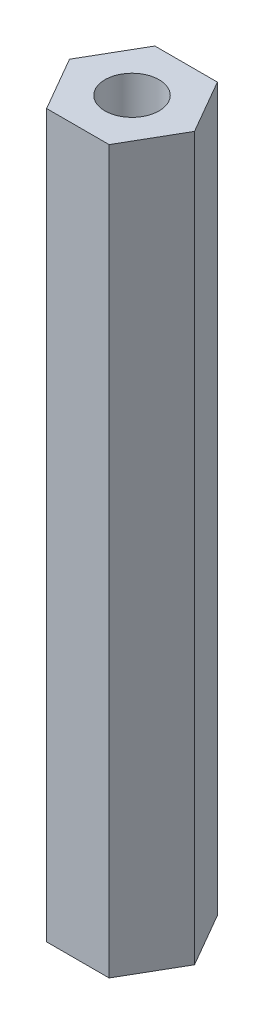
ISO-10303-21;
HEADER;
FILE_DESCRIPTION(('STEP AP214'),'2;1');
FILE_NAME('part.step','',(''),(''),'','','');
FILE_SCHEMA(('AUTOMOTIVE_DESIGN { 1 0 10303 214 1 1 1 1 }'));
ENDSEC;
DATA;
#1=APPLICATION_CONTEXT('core data for automotive mechanical design processes');
#2=APPLICATION_PROTOCOL_DEFINITION('international standard','automotive_design',2000,#1);
#3=PRODUCT_CONTEXT('',#1,'mechanical');
#4=PRODUCT('Part','Part','',(#3));
#5=PRODUCT_RELATED_PRODUCT_CATEGORY('part','',(#4));
#6=PRODUCT_DEFINITION_FORMATION('','',#4);
#7=PRODUCT_DEFINITION_CONTEXT('part definition',#1,'design');
#8=PRODUCT_DEFINITION('design','',#6,#7);
#9=PRODUCT_DEFINITION_SHAPE('','',#8);
#10=(LENGTH_UNIT() NAMED_UNIT(*) SI_UNIT(.MILLI.,.METRE.));
#11=(NAMED_UNIT(*) PLANE_ANGLE_UNIT() SI_UNIT($,.RADIAN.));
#12=(NAMED_UNIT(*) SI_UNIT($,.STERADIAN.) SOLID_ANGLE_UNIT());
#13=UNCERTAINTY_MEASURE_WITH_UNIT(LENGTH_MEASURE(1.E-05),#10,'distance_accuracy_value','');
#14=(GEOMETRIC_REPRESENTATION_CONTEXT(3) GLOBAL_UNCERTAINTY_ASSIGNED_CONTEXT((#13)) GLOBAL_UNIT_ASSIGNED_CONTEXT((#10,
#11,#12)) REPRESENTATION_CONTEXT('',''));
#15=CARTESIAN_POINT('',(0.,0.,0.));
#16=DIRECTION('',(0.,0.,1.));
#17=DIRECTION('',(1.,0.,0.));
#18=AXIS2_PLACEMENT_3D('',#15,#16,#17);
#19=CARTESIAN_POINT('',(0.,40.,0.));
#20=DIRECTION('',(0.,1.,0.));
#21=DIRECTION('',(0.,0.,1.));
#22=AXIS2_PLACEMENT_3D('',#19,#20,#21);
#23=PLANE('',#22);
#24=DIRECTION('',(0.5,0.,-0.866025403784439));
#25=VECTOR('',#24,1.);
#26=CARTESIAN_POINT('',(1.73205080756888,40.,3.));
#27=LINE('',#26,#25);
#28=CARTESIAN_POINT('',(1.73205080756888,40.,3.));
#29=VERTEX_POINT('',#28);
#30=CARTESIAN_POINT('',(3.46410161513776,40.,0.));
#31=VERTEX_POINT('',#30);
#32=EDGE_CURVE('E146',#29,#31,#27,.T.);
#33=ORIENTED_EDGE('',*,*,#32,.T.);
#34=DIRECTION('',(-0.5,0.,-0.866025403784439));
#35=VECTOR('',#34,1.);
#36=CARTESIAN_POINT('',(3.46410161513776,40.,0.));
#37=LINE('',#36,#35);
#38=CARTESIAN_POINT('',(1.73205080756888,40.,-3.));
#39=VERTEX_POINT('',#38);
#40=EDGE_CURVE('E94',#31,#39,#37,.T.);
#41=ORIENTED_EDGE('',*,*,#40,.T.);
#42=DIRECTION('',(-1.,0.,0.));
#43=VECTOR('',#42,1.);
#44=CARTESIAN_POINT('',(1.73205080756888,40.,-3.));
#45=LINE('',#44,#43);
#46=CARTESIAN_POINT('',(-1.73205080756888,40.,-3.));
#47=VERTEX_POINT('',#46);
#48=EDGE_CURVE('E107',#39,#47,#45,.T.);
#49=ORIENTED_EDGE('',*,*,#48,.T.);
#50=DIRECTION('',(-0.5,0.,0.866025403784439));
#51=VECTOR('',#50,1.);
#52=CARTESIAN_POINT('',(-1.73205080756888,40.,-3.));
#53=LINE('',#52,#51);
#54=CARTESIAN_POINT('',(-3.46410161513775,40.,0.));
#55=VERTEX_POINT('',#54);
#56=EDGE_CURVE('E101',#47,#55,#53,.T.);
#57=ORIENTED_EDGE('',*,*,#56,.T.);
#58=DIRECTION('',(0.5,0.,0.866025403784439));
#59=VECTOR('',#58,1.);
#60=CARTESIAN_POINT('',(-3.46410161513775,40.,0.));
#61=LINE('',#60,#59);
#62=CARTESIAN_POINT('',(-1.73205080756888,40.,3.));
#63=VERTEX_POINT('',#62);
#64=EDGE_CURVE('E105',#55,#63,#61,.T.);
#65=ORIENTED_EDGE('',*,*,#64,.T.);
#66=DIRECTION('',(1.,0.,0.));
#67=VECTOR('',#66,1.);
#68=CARTESIAN_POINT('',(-1.73205080756888,40.,3.));
#69=LINE('',#68,#67);
#70=EDGE_CURVE('E57',#63,#29,#69,.T.);
#71=ORIENTED_EDGE('',*,*,#70,.T.);
#72=EDGE_LOOP('',(#33,#41,#49,#57,#65,#71));
#73=FACE_BOUND('',#72,.T.);
#74=CARTESIAN_POINT('',(0.,40.,0.));
#75=DIRECTION('',(0.,1.,0.));
#76=DIRECTION('',(0.,0.,1.));
#77=AXIS2_PLACEMENT_3D('',#74,#75,#76);
#78=CIRCLE('',#77,1.5);
#79=CARTESIAN_POINT('',(0.,40.,1.5));
#80=VERTEX_POINT('',#79);
#81=EDGE_CURVE('E134',#80,#80,#78,.T.);
#82=ORIENTED_EDGE('',*,*,#81,.F.);
#83=EDGE_LOOP('',(#82));
#84=FACE_BOUND('',#83,.T.);
#85=ADVANCED_FACE('F39',(#73,#84),#23,.T.);
#86=CARTESIAN_POINT('',(0.,0.,0.));
#87=DIRECTION('',(0.,1.,0.));
#88=DIRECTION('',(0.,0.,1.));
#89=AXIS2_PLACEMENT_3D('',#86,#87,#88);
#90=PLANE('',#89);
#91=DIRECTION('',(0.5,0.,-0.866025403784439));
#92=VECTOR('',#91,1.);
#93=CARTESIAN_POINT('',(1.73205080756888,0.,3.));
#94=LINE('',#93,#92);
#95=CARTESIAN_POINT('',(1.73205080756888,0.,3.));
#96=VERTEX_POINT('',#95);
#97=CARTESIAN_POINT('',(3.46410161513776,0.,0.));
#98=VERTEX_POINT('',#97);
#99=EDGE_CURVE('E129',#96,#98,#94,.T.);
#100=ORIENTED_EDGE('',*,*,#99,.F.);
#101=DIRECTION('',(1.,0.,0.));
#102=VECTOR('',#101,1.);
#103=CARTESIAN_POINT('',(-1.73205080756888,0.,3.));
#104=LINE('',#103,#102);
#105=CARTESIAN_POINT('',(-1.73205080756888,0.,3.));
#106=VERTEX_POINT('',#105);
#107=EDGE_CURVE('E86',#106,#96,#104,.T.);
#108=ORIENTED_EDGE('',*,*,#107,.F.);
#109=DIRECTION('',(0.5,0.,0.866025403784439));
#110=VECTOR('',#109,1.);
#111=CARTESIAN_POINT('',(-3.46410161513775,0.,0.));
#112=LINE('',#111,#110);
#113=CARTESIAN_POINT('',(-3.46410161513775,0.,0.));
#114=VERTEX_POINT('',#113);
#115=EDGE_CURVE('E80',#114,#106,#112,.T.);
#116=ORIENTED_EDGE('',*,*,#115,.F.);
#117=DIRECTION('',(-0.5,0.,0.866025403784439));
#118=VECTOR('',#117,1.);
#119=CARTESIAN_POINT('',(-1.73205080756888,0.,-3.));
#120=LINE('',#119,#118);
#121=CARTESIAN_POINT('',(-1.73205080756888,0.,-3.));
#122=VERTEX_POINT('',#121);
#123=EDGE_CURVE('E116',#122,#114,#120,.T.);
#124=ORIENTED_EDGE('',*,*,#123,.F.);
#125=DIRECTION('',(-1.,0.,0.));
#126=VECTOR('',#125,1.);
#127=CARTESIAN_POINT('',(1.73205080756888,0.,-3.));
#128=LINE('',#127,#126);
#129=CARTESIAN_POINT('',(1.73205080756888,0.,-3.));
#130=VERTEX_POINT('',#129);
#131=EDGE_CURVE('E137',#130,#122,#128,.T.);
#132=ORIENTED_EDGE('',*,*,#131,.F.);
#133=DIRECTION('',(-0.5,0.,-0.866025403784439));
#134=VECTOR('',#133,1.);
#135=CARTESIAN_POINT('',(3.46410161513776,0.,0.));
#136=LINE('',#135,#134);
#137=EDGE_CURVE('E133',#98,#130,#136,.T.);
#138=ORIENTED_EDGE('',*,*,#137,.F.);
#139=EDGE_LOOP('',(#100,#108,#116,#124,#132,#138));
#140=FACE_BOUND('',#139,.T.);
#141=CARTESIAN_POINT('',(0.,0.,0.));
#142=DIRECTION('',(0.,1.,0.));
#143=DIRECTION('',(0.,0.,1.));
#144=AXIS2_PLACEMENT_3D('',#141,#142,#143);
#145=CIRCLE('',#144,1.5);
#146=CARTESIAN_POINT('',(0.,0.,1.5));
#147=VERTEX_POINT('',#146);
#148=EDGE_CURVE('E243',#147,#147,#145,.T.);
#149=ORIENTED_EDGE('',*,*,#148,.T.);
#150=EDGE_LOOP('',(#149));
#151=FACE_BOUND('',#150,.T.);
#152=ADVANCED_FACE('F159',(#140,#151),#90,.F.);
#153=CARTESIAN_POINT('',(1.73205080756888,40.,3.));
#154=DIRECTION('',(-0.866025403784439,0.,-0.5));
#155=DIRECTION('',(-0.5,0.,0.866025403784439));
#156=AXIS2_PLACEMENT_3D('',#153,#154,#155);
#157=PLANE('',#156);
#158=ORIENTED_EDGE('',*,*,#99,.T.);
#159=DIRECTION('',(0.,-1.,0.));
#160=VECTOR('',#159,1.);
#161=CARTESIAN_POINT('',(3.46410161513776,40.,0.));
#162=LINE('',#161,#160);
#163=EDGE_CURVE('E11',#31,#98,#162,.T.);
#164=ORIENTED_EDGE('',*,*,#163,.F.);
#165=ORIENTED_EDGE('',*,*,#32,.F.);
#166=DIRECTION('',(0.,-1.,0.));
#167=VECTOR('',#166,1.);
#168=CARTESIAN_POINT('',(1.73205080756888,40.,3.));
#169=LINE('',#168,#167);
#170=EDGE_CURVE('E125',#29,#96,#169,.T.);
#171=ORIENTED_EDGE('',*,*,#170,.T.);
#172=EDGE_LOOP('',(#158,#164,#165,#171));
#173=FACE_BOUND('',#172,.T.);
#174=ADVANCED_FACE('F41',(#173),#157,.F.);
#175=CARTESIAN_POINT('',(3.46410161513776,40.,0.));
#176=DIRECTION('',(-0.866025403784439,0.,0.5));
#177=DIRECTION('',(0.5,0.,0.866025403784439));
#178=AXIS2_PLACEMENT_3D('',#175,#176,#177);
#179=PLANE('',#178);
#180=ORIENTED_EDGE('',*,*,#137,.T.);
#181=DIRECTION('',(0.,-1.,0.));
#182=VECTOR('',#181,1.);
#183=CARTESIAN_POINT('',(1.73205080756888,40.,-3.));
#184=LINE('',#183,#182);
#185=EDGE_CURVE('E49',#39,#130,#184,.T.);
#186=ORIENTED_EDGE('',*,*,#185,.F.);
#187=ORIENTED_EDGE('',*,*,#40,.F.);
#188=ORIENTED_EDGE('',*,*,#163,.T.);
#189=EDGE_LOOP('',(#180,#186,#187,#188));
#190=FACE_BOUND('',#189,.T.);
#191=ADVANCED_FACE('F184',(#190),#179,.F.);
#192=CARTESIAN_POINT('',(1.73205080756888,40.,-3.));
#193=DIRECTION('',(0.,0.,1.));
#194=DIRECTION('',(1.,0.,0.));
#195=AXIS2_PLACEMENT_3D('',#192,#193,#194);
#196=PLANE('',#195);
#197=ORIENTED_EDGE('',*,*,#131,.T.);
#198=DIRECTION('',(0.,-1.,0.));
#199=VECTOR('',#198,1.);
#200=CARTESIAN_POINT('',(-1.73205080756888,40.,-3.));
#201=LINE('',#200,#199);
#202=EDGE_CURVE('E118',#47,#122,#201,.T.);
#203=ORIENTED_EDGE('',*,*,#202,.F.);
#204=ORIENTED_EDGE('',*,*,#48,.F.);
#205=ORIENTED_EDGE('',*,*,#185,.T.);
#206=EDGE_LOOP('',(#197,#203,#204,#205));
#207=FACE_BOUND('',#206,.T.);
#208=ADVANCED_FACE('F156',(#207),#196,.F.);
#209=CARTESIAN_POINT('',(-1.73205080756888,40.,-3.));
#210=DIRECTION('',(0.866025403784439,0.,0.5));
#211=DIRECTION('',(0.5,0.,-0.866025403784439));
#212=AXIS2_PLACEMENT_3D('',#209,#210,#211);
#213=PLANE('',#212);
#214=ORIENTED_EDGE('',*,*,#123,.T.);
#215=DIRECTION('',(0.,-1.,0.));
#216=VECTOR('',#215,1.);
#217=CARTESIAN_POINT('',(-3.46410161513775,40.,0.));
#218=LINE('',#217,#216);
#219=EDGE_CURVE('E113',#55,#114,#218,.T.);
#220=ORIENTED_EDGE('',*,*,#219,.F.);
#221=ORIENTED_EDGE('',*,*,#56,.F.);
#222=ORIENTED_EDGE('',*,*,#202,.T.);
#223=EDGE_LOOP('',(#214,#220,#221,#222));
#224=FACE_BOUND('',#223,.T.);
#225=ADVANCED_FACE('F114',(#224),#213,.F.);
#226=CARTESIAN_POINT('',(-3.46410161513775,40.,0.));
#227=DIRECTION('',(0.866025403784439,0.,-0.5));
#228=DIRECTION('',(-0.5,0.,-0.866025403784439));
#229=AXIS2_PLACEMENT_3D('',#226,#227,#228);
#230=PLANE('',#229);
#231=ORIENTED_EDGE('',*,*,#115,.T.);
#232=DIRECTION('',(0.,-1.,0.));
#233=VECTOR('',#232,1.);
#234=CARTESIAN_POINT('',(-1.73205080756888,40.,3.));
#235=LINE('',#234,#233);
#236=EDGE_CURVE('E119',#63,#106,#235,.T.);
#237=ORIENTED_EDGE('',*,*,#236,.F.);
#238=ORIENTED_EDGE('',*,*,#64,.F.);
#239=ORIENTED_EDGE('',*,*,#219,.T.);
#240=EDGE_LOOP('',(#231,#237,#238,#239));
#241=FACE_BOUND('',#240,.T.);
#242=ADVANCED_FACE('F121',(#241),#230,.F.);
#243=CARTESIAN_POINT('',(-1.73205080756888,40.,3.));
#244=DIRECTION('',(0.,0.,-1.));
#245=DIRECTION('',(-1.,0.,0.));
#246=AXIS2_PLACEMENT_3D('',#243,#244,#245);
#247=PLANE('',#246);
#248=ORIENTED_EDGE('',*,*,#107,.T.);
#249=ORIENTED_EDGE('',*,*,#170,.F.);
#250=ORIENTED_EDGE('',*,*,#70,.F.);
#251=ORIENTED_EDGE('',*,*,#236,.T.);
#252=EDGE_LOOP('',(#248,#249,#250,#251));
#253=FACE_BOUND('',#252,.T.);
#254=ADVANCED_FACE('F164',(#253),#247,.F.);
#255=CARTESIAN_POINT('',(0.,40.,0.));
#256=DIRECTION('',(0.,-1.,0.));
#257=DIRECTION('',(0.,0.,-1.));
#258=AXIS2_PLACEMENT_3D('',#255,#256,#257);
#259=CYLINDRICAL_SURFACE('',#258,1.5);
#260=ORIENTED_EDGE('',*,*,#81,.T.);
#261=EDGE_LOOP('',(#260));
#262=FACE_BOUND('',#261,.T.);
#263=ORIENTED_EDGE('',*,*,#148,.F.);
#264=EDGE_LOOP('',(#263));
#265=FACE_BOUND('',#264,.T.);
#266=ADVANCED_FACE('F166',(#262,#265),#259,.F.);
#267=CLOSED_SHELL('',(#85,#152,#174,#191,#208,#225,#242,#254,#266));
#268=MANIFOLD_SOLID_BREP('B2',#267);
#269=ADVANCED_BREP_SHAPE_REPRESENTATION('',(#18,#268),#14);
#270=SHAPE_DEFINITION_REPRESENTATION(#9,#269);
ENDSEC;
END-ISO-10303-21;
